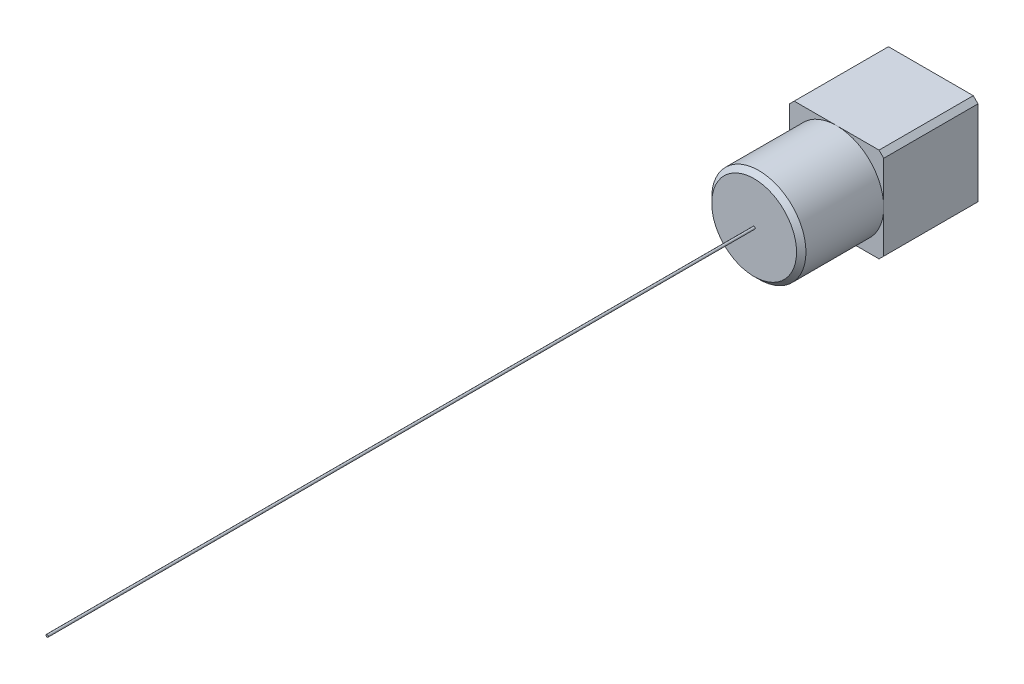
ISO-10303-21;
HEADER;
FILE_DESCRIPTION(('STEP AP214'),'2;1');
FILE_NAME('part.step','',(''),(''),'','','');
FILE_SCHEMA(('AUTOMOTIVE_DESIGN { 1 0 10303 214 1 1 1 1 }'));
ENDSEC;
DATA;
#1=APPLICATION_CONTEXT('core data for automotive mechanical design processes');
#2=APPLICATION_PROTOCOL_DEFINITION('international standard','automotive_design',2000,#1);
#3=PRODUCT_CONTEXT('',#1,'mechanical');
#4=PRODUCT('Part','Part','',(#3));
#5=PRODUCT_RELATED_PRODUCT_CATEGORY('part','',(#4));
#6=PRODUCT_DEFINITION_FORMATION('','',#4);
#7=PRODUCT_DEFINITION_CONTEXT('part definition',#1,'design');
#8=PRODUCT_DEFINITION('design','',#6,#7);
#9=PRODUCT_DEFINITION_SHAPE('','',#8);
#10=(LENGTH_UNIT() NAMED_UNIT(*) SI_UNIT(.MILLI.,.METRE.));
#11=(NAMED_UNIT(*) PLANE_ANGLE_UNIT() SI_UNIT($,.RADIAN.));
#12=(NAMED_UNIT(*) SI_UNIT($,.STERADIAN.) SOLID_ANGLE_UNIT());
#13=UNCERTAINTY_MEASURE_WITH_UNIT(LENGTH_MEASURE(1.E-05),#10,'distance_accuracy_value','');
#14=(GEOMETRIC_REPRESENTATION_CONTEXT(3) GLOBAL_UNCERTAINTY_ASSIGNED_CONTEXT((#13)) GLOBAL_UNIT_ASSIGNED_CONTEXT((#10,
#11,#12)) REPRESENTATION_CONTEXT('',''));
#15=CARTESIAN_POINT('',(0.,0.,0.));
#16=DIRECTION('',(0.,0.,1.));
#17=DIRECTION('',(1.,0.,0.));
#18=AXIS2_PLACEMENT_3D('',#15,#16,#17);
#19=CARTESIAN_POINT('',(0.,0.,75.));
#20=DIRECTION('',(0.,0.,1.));
#21=DIRECTION('',(1.,0.,0.));
#22=AXIS2_PLACEMENT_3D('',#19,#20,#21);
#23=PLANE('',#22);
#24=CARTESIAN_POINT('',(0.,0.,75.));
#25=DIRECTION('',(0.,0.,1.));
#26=DIRECTION('',(1.,0.,0.));
#27=AXIS2_PLACEMENT_3D('',#24,#25,#26);
#28=CIRCLE('',#27,18.);
#29=CARTESIAN_POINT('',(18.,0.,75.));
#30=VERTEX_POINT('',#29);
#31=EDGE_CURVE('E42',#30,#30,#28,.T.);
#32=ORIENTED_EDGE('',*,*,#31,.T.);
#33=EDGE_LOOP('',(#32));
#34=FACE_BOUND('',#33,.T.);
#35=CARTESIAN_POINT('',(0.,0.,75.));
#36=DIRECTION('',(0.,0.,1.));
#37=DIRECTION('',(1.,0.,0.));
#38=AXIS2_PLACEMENT_3D('',#35,#36,#37);
#39=CIRCLE('',#38,0.5);
#40=CARTESIAN_POINT('',(0.5,0.,75.));
#41=VERTEX_POINT('',#40);
#42=EDGE_CURVE('E153',#41,#41,#39,.T.);
#43=ORIENTED_EDGE('',*,*,#42,.F.);
#44=EDGE_LOOP('',(#43));
#45=FACE_BOUND('',#44,.T.);
#46=ADVANCED_FACE('F34',(#34,#45),#23,.T.);
#47=CARTESIAN_POINT('',(0.,0.,0.));
#48=DIRECTION('',(0.,0.,1.));
#49=DIRECTION('',(1.,0.,0.));
#50=AXIS2_PLACEMENT_3D('',#47,#48,#49);
#51=PLANE('',#50);
#52=CARTESIAN_POINT('',(-8.63222484007207,8.08184808852399,0.));
#53=DIRECTION('',(0.,0.,1.));
#54=DIRECTION('',(1.,0.,0.));
#55=AXIS2_PLACEMENT_3D('',#52,#53,#54);
#56=CIRCLE('',#55,3.93917618800255);
#57=CARTESIAN_POINT('',(-4.69304865206951,8.08184808852399,0.));
#58=VERTEX_POINT('',#57);
#59=EDGE_CURVE('E172',#58,#58,#56,.T.);
#60=ORIENTED_EDGE('',*,*,#59,.T.);
#61=EDGE_LOOP('',(#60));
#62=FACE_BOUND('',#61,.T.);
#63=DIRECTION('',(0.,1.,0.));
#64=VECTOR('',#63,1.);
#65=CARTESIAN_POINT('',(20.,-20.,0.));
#66=LINE('',#65,#64);
#67=CARTESIAN_POINT('',(20.,-18.,0.));
#68=VERTEX_POINT('',#67);
#69=CARTESIAN_POINT('',(20.,18.,0.));
#70=VERTEX_POINT('',#69);
#71=EDGE_CURVE('E165',#68,#70,#66,.T.);
#72=ORIENTED_EDGE('',*,*,#71,.F.);
#73=DIRECTION('',(0.70710678118655,0.707106781186545,0.));
#74=VECTOR('',#73,1.);
#75=CARTESIAN_POINT('',(20.,-18.,0.));
#76=LINE('',#75,#74);
#77=CARTESIAN_POINT('',(18.,-20.,0.));
#78=VERTEX_POINT('',#77);
#79=EDGE_CURVE('E190',#68,#78,#76,.F.);
#80=ORIENTED_EDGE('',*,*,#79,.T.);
#81=DIRECTION('',(1.,0.,0.));
#82=VECTOR('',#81,1.);
#83=CARTESIAN_POINT('',(20.,-20.,0.));
#84=LINE('',#83,#82);
#85=CARTESIAN_POINT('',(-18.,-20.,0.));
#86=VERTEX_POINT('',#85);
#87=EDGE_CURVE('E162',#86,#78,#84,.T.);
#88=ORIENTED_EDGE('',*,*,#87,.F.);
#89=DIRECTION('',(0.707106781186545,-0.70710678118655,0.));
#90=VECTOR('',#89,1.);
#91=CARTESIAN_POINT('',(-18.,-20.,0.));
#92=LINE('',#91,#90);
#93=CARTESIAN_POINT('',(-20.,-18.,0.));
#94=VERTEX_POINT('',#93);
#95=EDGE_CURVE('E188',#86,#94,#92,.F.);
#96=ORIENTED_EDGE('',*,*,#95,.T.);
#97=DIRECTION('',(0.,-1.,0.));
#98=VECTOR('',#97,1.);
#99=CARTESIAN_POINT('',(-20.,-20.,0.));
#100=LINE('',#99,#98);
#101=CARTESIAN_POINT('',(-20.,18.,0.));
#102=VERTEX_POINT('',#101);
#103=EDGE_CURVE('E142',#102,#94,#100,.T.);
#104=ORIENTED_EDGE('',*,*,#103,.F.);
#105=DIRECTION('',(-0.707106781186551,-0.707106781186544,0.));
#106=VECTOR('',#105,1.);
#107=CARTESIAN_POINT('',(-20.,18.,0.));
#108=LINE('',#107,#106);
#109=CARTESIAN_POINT('',(-18.,20.,0.));
#110=VERTEX_POINT('',#109);
#111=EDGE_CURVE('E184',#102,#110,#108,.F.);
#112=ORIENTED_EDGE('',*,*,#111,.T.);
#113=DIRECTION('',(-1.,0.,0.));
#114=VECTOR('',#113,1.);
#115=CARTESIAN_POINT('',(20.,20.,0.));
#116=LINE('',#115,#114);
#117=CARTESIAN_POINT('',(18.,20.,0.));
#118=VERTEX_POINT('',#117);
#119=EDGE_CURVE('E167',#118,#110,#116,.T.);
#120=ORIENTED_EDGE('',*,*,#119,.F.);
#121=DIRECTION('',(-0.70710678118655,0.707106781186545,0.));
#122=VECTOR('',#121,1.);
#123=CARTESIAN_POINT('',(18.,20.,0.));
#124=LINE('',#123,#122);
#125=EDGE_CURVE('E186',#118,#70,#124,.F.);
#126=ORIENTED_EDGE('',*,*,#125,.T.);
#127=EDGE_LOOP('',(#72,#80,#88,#96,#104,#112,#120,#126));
#128=FACE_BOUND('',#127,.T.);
#129=ADVANCED_FACE('F231',(#62,#128),#51,.F.);
#130=CARTESIAN_POINT('',(0.,0.,40.));
#131=DIRECTION('',(0.,0.,1.));
#132=DIRECTION('',(1.,0.,0.));
#133=AXIS2_PLACEMENT_3D('',#130,#131,#132);
#134=PLANE('',#133);
#135=DIRECTION('',(0.,1.,0.));
#136=VECTOR('',#135,1.);
#137=CARTESIAN_POINT('',(20.,-20.,40.));
#138=LINE('',#137,#136);
#139=CARTESIAN_POINT('',(20.,0.,40.));
#140=VERTEX_POINT('',#139);
#141=CARTESIAN_POINT('',(20.,18.,40.));
#142=VERTEX_POINT('',#141);
#143=EDGE_CURVE('E127',#140,#142,#138,.T.);
#144=ORIENTED_EDGE('',*,*,#143,.T.);
#145=DIRECTION('',(0.70710678118655,-0.707106781186545,0.));
#146=VECTOR('',#145,1.);
#147=CARTESIAN_POINT('',(18.9999999999999,19.0000000000001,40.));
#148=LINE('',#147,#146);
#149=CARTESIAN_POINT('',(18.,20.,40.));
#150=VERTEX_POINT('',#149);
#151=EDGE_CURVE('E49',#142,#150,#148,.F.);
#152=ORIENTED_EDGE('',*,*,#151,.T.);
#153=DIRECTION('',(-1.,0.,0.));
#154=VECTOR('',#153,1.);
#155=CARTESIAN_POINT('',(20.,20.,40.));
#156=LINE('',#155,#154);
#157=CARTESIAN_POINT('',(0.,20.,40.));
#158=VERTEX_POINT('',#157);
#159=EDGE_CURVE('E138',#150,#158,#156,.T.);
#160=ORIENTED_EDGE('',*,*,#159,.T.);
#161=CARTESIAN_POINT('',(0.,0.,40.));
#162=DIRECTION('',(0.,0.,1.));
#163=DIRECTION('',(1.,0.,0.));
#164=AXIS2_PLACEMENT_3D('',#161,#162,#163);
#165=CIRCLE('',#164,20.);
#166=EDGE_CURVE('E136',#140,#158,#165,.T.);
#167=ORIENTED_EDGE('',*,*,#166,.F.);
#168=EDGE_LOOP('',(#144,#152,#160,#167));
#169=FACE_BOUND('',#168,.T.);
#170=ADVANCED_FACE('F137',(#169),#134,.T.);
#171=CARTESIAN_POINT('',(-18.,20.,40.));
#172=VERTEX_POINT('',#171);
#173=EDGE_CURVE('E126',#158,#172,#156,.T.);
#174=ORIENTED_EDGE('',*,*,#173,.T.);
#175=DIRECTION('',(0.707106781186551,0.707106781186544,0.));
#176=VECTOR('',#175,1.);
#177=CARTESIAN_POINT('',(-18.9999999999999,19.0000000000001,40.));
#178=LINE('',#177,#176);
#179=CARTESIAN_POINT('',(-20.,18.,40.));
#180=VERTEX_POINT('',#179);
#181=EDGE_CURVE('E210',#172,#180,#178,.F.);
#182=ORIENTED_EDGE('',*,*,#181,.T.);
#183=DIRECTION('',(0.,-1.,0.));
#184=VECTOR('',#183,1.);
#185=CARTESIAN_POINT('',(-20.,-20.,40.));
#186=LINE('',#185,#184);
#187=CARTESIAN_POINT('',(-20.,0.,40.));
#188=VERTEX_POINT('',#187);
#189=EDGE_CURVE('E155',#180,#188,#186,.T.);
#190=ORIENTED_EDGE('',*,*,#189,.T.);
#191=EDGE_CURVE('E145',#158,#188,#165,.T.);
#192=ORIENTED_EDGE('',*,*,#191,.F.);
#193=EDGE_LOOP('',(#174,#182,#190,#192));
#194=FACE_BOUND('',#193,.T.);
#195=ADVANCED_FACE('F294',(#194),#134,.T.);
#196=CARTESIAN_POINT('',(-20.,-18.,40.));
#197=VERTEX_POINT('',#196);
#198=EDGE_CURVE('E158',#188,#197,#186,.T.);
#199=ORIENTED_EDGE('',*,*,#198,.T.);
#200=DIRECTION('',(-0.707106781186545,0.70710678118655,0.));
#201=VECTOR('',#200,1.);
#202=CARTESIAN_POINT('',(-19.0000000000001,-18.9999999999999,40.));
#203=LINE('',#202,#201);
#204=CARTESIAN_POINT('',(-18.,-20.,40.));
#205=VERTEX_POINT('',#204);
#206=EDGE_CURVE('E203',#197,#205,#203,.F.);
#207=ORIENTED_EDGE('',*,*,#206,.T.);
#208=DIRECTION('',(1.,0.,0.));
#209=VECTOR('',#208,1.);
#210=CARTESIAN_POINT('',(20.,-20.,40.));
#211=LINE('',#210,#209);
#212=CARTESIAN_POINT('',(0.,-20.,40.));
#213=VERTEX_POINT('',#212);
#214=EDGE_CURVE('E134',#205,#213,#211,.T.);
#215=ORIENTED_EDGE('',*,*,#214,.T.);
#216=EDGE_CURVE('E149',#188,#213,#165,.T.);
#217=ORIENTED_EDGE('',*,*,#216,.F.);
#218=EDGE_LOOP('',(#199,#207,#215,#217));
#219=FACE_BOUND('',#218,.T.);
#220=ADVANCED_FACE('F247',(#219),#134,.T.);
#221=CARTESIAN_POINT('',(-20.,-20.,40.));
#222=DIRECTION('',(1.,0.,0.));
#223=DIRECTION('',(0.,0.,-1.));
#224=AXIS2_PLACEMENT_3D('',#221,#222,#223);
#225=PLANE('',#224);
#226=ORIENTED_EDGE('',*,*,#103,.T.);
#227=DIRECTION('',(0.,0.,1.));
#228=VECTOR('',#227,1.);
#229=CARTESIAN_POINT('',(-20.,-18.,40.));
#230=LINE('',#229,#228);
#231=EDGE_CURVE('E201',#94,#197,#230,.T.);
#232=ORIENTED_EDGE('',*,*,#231,.T.);
#233=ORIENTED_EDGE('',*,*,#198,.F.);
#234=ORIENTED_EDGE('',*,*,#189,.F.);
#235=DIRECTION('',(0.,0.,-1.));
#236=VECTOR('',#235,1.);
#237=CARTESIAN_POINT('',(-20.,18.,40.));
#238=LINE('',#237,#236);
#239=EDGE_CURVE('E198',#180,#102,#238,.T.);
#240=ORIENTED_EDGE('',*,*,#239,.T.);
#241=EDGE_LOOP('',(#226,#232,#233,#234,#240));
#242=FACE_BOUND('',#241,.T.);
#243=ADVANCED_FACE('F256',(#242),#225,.F.);
#244=CARTESIAN_POINT('',(20.,-20.,40.));
#245=DIRECTION('',(0.,1.,0.));
#246=DIRECTION('',(-1.,0.,0.));
#247=AXIS2_PLACEMENT_3D('',#244,#245,#246);
#248=PLANE('',#247);
#249=ORIENTED_EDGE('',*,*,#87,.T.);
#250=DIRECTION('',(0.,0.,1.));
#251=VECTOR('',#250,1.);
#252=CARTESIAN_POINT('',(18.,-20.,40.));
#253=LINE('',#252,#251);
#254=CARTESIAN_POINT('',(18.,-20.,40.));
#255=VERTEX_POINT('',#254);
#256=EDGE_CURVE('E195',#78,#255,#253,.T.);
#257=ORIENTED_EDGE('',*,*,#256,.T.);
#258=EDGE_CURVE('E157',#213,#255,#211,.T.);
#259=ORIENTED_EDGE('',*,*,#258,.F.);
#260=ORIENTED_EDGE('',*,*,#214,.F.);
#261=DIRECTION('',(0.,0.,-1.));
#262=VECTOR('',#261,1.);
#263=CARTESIAN_POINT('',(-18.,-20.,40.));
#264=LINE('',#263,#262);
#265=EDGE_CURVE('E192',#205,#86,#264,.T.);
#266=ORIENTED_EDGE('',*,*,#265,.T.);
#267=EDGE_LOOP('',(#249,#257,#259,#260,#266));
#268=FACE_BOUND('',#267,.T.);
#269=ADVANCED_FACE('F253',(#268),#248,.F.);
#270=CARTESIAN_POINT('',(20.,-20.,40.));
#271=DIRECTION('',(-1.,0.,0.));
#272=DIRECTION('',(0.,0.,1.));
#273=AXIS2_PLACEMENT_3D('',#270,#271,#272);
#274=PLANE('',#273);
#275=CARTESIAN_POINT('',(20.,-18.,40.));
#276=VERTEX_POINT('',#275);
#277=EDGE_CURVE('E114',#276,#140,#138,.T.);
#278=ORIENTED_EDGE('',*,*,#277,.F.);
#279=DIRECTION('',(0.,0.,-1.));
#280=VECTOR('',#279,1.);
#281=CARTESIAN_POINT('',(20.,-18.,40.));
#282=LINE('',#281,#280);
#283=EDGE_CURVE('E182',#276,#68,#282,.T.);
#284=ORIENTED_EDGE('',*,*,#283,.T.);
#285=ORIENTED_EDGE('',*,*,#71,.T.);
#286=DIRECTION('',(0.,0.,1.));
#287=VECTOR('',#286,1.);
#288=CARTESIAN_POINT('',(20.,18.,40.));
#289=LINE('',#288,#287);
#290=EDGE_CURVE('E133',#70,#142,#289,.T.);
#291=ORIENTED_EDGE('',*,*,#290,.T.);
#292=ORIENTED_EDGE('',*,*,#143,.F.);
#293=EDGE_LOOP('',(#278,#284,#285,#291,#292));
#294=FACE_BOUND('',#293,.T.);
#295=ADVANCED_FACE('F130',(#294),#274,.F.);
#296=CARTESIAN_POINT('',(20.,20.,40.));
#297=DIRECTION('',(0.,-1.,0.));
#298=DIRECTION('',(1.,0.,0.));
#299=AXIS2_PLACEMENT_3D('',#296,#297,#298);
#300=PLANE('',#299);
#301=ORIENTED_EDGE('',*,*,#159,.F.);
#302=DIRECTION('',(0.,0.,-1.));
#303=VECTOR('',#302,1.);
#304=CARTESIAN_POINT('',(18.,20.,40.));
#305=LINE('',#304,#303);
#306=EDGE_CURVE('E206',#150,#118,#305,.T.);
#307=ORIENTED_EDGE('',*,*,#306,.T.);
#308=ORIENTED_EDGE('',*,*,#119,.T.);
#309=DIRECTION('',(0.,0.,1.));
#310=VECTOR('',#309,1.);
#311=CARTESIAN_POINT('',(-18.,20.,40.));
#312=LINE('',#311,#310);
#313=EDGE_CURVE('E57',#110,#172,#312,.T.);
#314=ORIENTED_EDGE('',*,*,#313,.T.);
#315=ORIENTED_EDGE('',*,*,#173,.F.);
#316=EDGE_LOOP('',(#301,#307,#308,#314,#315));
#317=FACE_BOUND('',#316,.T.);
#318=ADVANCED_FACE('F246',(#317),#300,.F.);
#319=ORIENTED_EDGE('',*,*,#258,.T.);
#320=DIRECTION('',(-0.70710678118655,-0.707106781186545,0.));
#321=VECTOR('',#320,1.);
#322=CARTESIAN_POINT('',(18.9999999999999,-19.0000000000001,40.));
#323=LINE('',#322,#321);
#324=EDGE_CURVE('E122',#255,#276,#323,.F.);
#325=ORIENTED_EDGE('',*,*,#324,.T.);
#326=ORIENTED_EDGE('',*,*,#277,.T.);
#327=EDGE_CURVE('E119',#213,#140,#165,.T.);
#328=ORIENTED_EDGE('',*,*,#327,.F.);
#329=EDGE_LOOP('',(#319,#325,#326,#328));
#330=FACE_BOUND('',#329,.T.);
#331=ADVANCED_FACE('F117',(#330),#134,.T.);
#332=CARTESIAN_POINT('',(0.,0.,75.));
#333=DIRECTION('',(0.,0.,-1.));
#334=DIRECTION('',(-1.,0.,0.));
#335=AXIS2_PLACEMENT_3D('',#332,#333,#334);
#336=CYLINDRICAL_SURFACE('',#335,20.);
#337=CARTESIAN_POINT('',(0.,0.,73.));
#338=DIRECTION('',(0.,0.,1.));
#339=DIRECTION('',(1.,0.,0.));
#340=AXIS2_PLACEMENT_3D('',#337,#338,#339);
#341=CIRCLE('',#340,20.);
#342=CARTESIAN_POINT('',(20.,0.,73.));
#343=VERTEX_POINT('',#342);
#344=EDGE_CURVE('E11',#343,#343,#341,.F.);
#345=ORIENTED_EDGE('',*,*,#344,.T.);
#346=EDGE_LOOP('',(#345));
#347=FACE_BOUND('',#346,.T.);
#348=ORIENTED_EDGE('',*,*,#166,.T.);
#349=ORIENTED_EDGE('',*,*,#191,.T.);
#350=ORIENTED_EDGE('',*,*,#216,.T.);
#351=ORIENTED_EDGE('',*,*,#327,.T.);
#352=EDGE_LOOP('',(#348,#349,#350,#351));
#353=FACE_BOUND('',#352,.T.);
#354=ADVANCED_FACE('F147',(#347,#353),#336,.T.);
#355=CARTESIAN_POINT('',(-8.63222484007207,8.08184808852399,-5.));
#356=DIRECTION('',(0.,0.,1.));
#357=DIRECTION('',(1.,0.,0.));
#358=AXIS2_PLACEMENT_3D('',#355,#356,#357);
#359=CYLINDRICAL_SURFACE('',#358,3.43917618800255);
#360=CARTESIAN_POINT('',(-8.63222484007207,8.08184808852399,-4.50000000000001));
#361=DIRECTION('',(0.,0.,-1.));
#362=DIRECTION('',(-1.,0.,0.));
#363=AXIS2_PLACEMENT_3D('',#360,#361,#362);
#364=CIRCLE('',#363,3.43917618800255);
#365=CARTESIAN_POINT('',(-12.0714010280746,8.08184808852399,-4.50000000000001));
#366=VERTEX_POINT('',#365);
#367=EDGE_CURVE('E178',#366,#366,#364,.F.);
#368=ORIENTED_EDGE('',*,*,#367,.T.);
#369=EDGE_LOOP('',(#368));
#370=FACE_BOUND('',#369,.T.);
#371=CARTESIAN_POINT('',(-8.63222484007207,8.08184808852399,-0.5));
#372=DIRECTION('',(0.,0.,1.));
#373=DIRECTION('',(1.,0.,0.));
#374=AXIS2_PLACEMENT_3D('',#371,#372,#373);
#375=CIRCLE('',#374,3.43917618800255);
#376=CARTESIAN_POINT('',(-5.19304865206951,8.08184808852399,-0.5));
#377=VERTEX_POINT('',#376);
#378=EDGE_CURVE('E169',#377,#377,#375,.F.);
#379=ORIENTED_EDGE('',*,*,#378,.T.);
#380=EDGE_LOOP('',(#379));
#381=FACE_BOUND('',#380,.T.);
#382=ADVANCED_FACE('F240',(#370,#381),#359,.T.);
#383=CARTESIAN_POINT('',(-8.63222484007207,8.08184808852399,-5.));
#384=DIRECTION('',(0.,0.,-1.));
#385=DIRECTION('',(-1.,0.,0.));
#386=AXIS2_PLACEMENT_3D('',#383,#384,#385);
#387=PLANE('',#386);
#388=CARTESIAN_POINT('',(-8.63222484007207,8.08184808852399,-5.));
#389=DIRECTION('',(0.,0.,-1.));
#390=DIRECTION('',(-1.,0.,0.));
#391=AXIS2_PLACEMENT_3D('',#388,#389,#390);
#392=CIRCLE('',#391,2.93917618800257);
#393=CARTESIAN_POINT('',(-11.5714010280746,8.08184808852399,-5.));
#394=VERTEX_POINT('',#393);
#395=EDGE_CURVE('E175',#394,#394,#392,.T.);
#396=ORIENTED_EDGE('',*,*,#395,.T.);
#397=EDGE_LOOP('',(#396));
#398=FACE_BOUND('',#397,.T.);
#399=ADVANCED_FACE('F265',(#398),#387,.T.);
#400=CARTESIAN_POINT('',(-8.63222484007207,8.08184808852399,-0.5));
#401=DIRECTION('',(0.,0.,1.));
#402=DIRECTION('',(1.,0.,0.));
#403=AXIS2_PLACEMENT_3D('',#400,#401,#402);
#404=TOROIDAL_SURFACE('',#403,3.93917618800255,0.5);
#405=ORIENTED_EDGE('',*,*,#59,.F.);
#406=EDGE_LOOP('',(#405));
#407=FACE_BOUND('',#406,.T.);
#408=ORIENTED_EDGE('',*,*,#378,.F.);
#409=EDGE_LOOP('',(#408));
#410=FACE_BOUND('',#409,.T.);
#411=ADVANCED_FACE('F261',(#407,#410),#404,.F.);
#412=CARTESIAN_POINT('',(-8.63222484007207,8.08184808852399,-5.));
#413=DIRECTION('',(0.,0.,1.));
#414=DIRECTION('',(1.,0.,0.));
#415=AXIS2_PLACEMENT_3D('',#412,#413,#414);
#416=CONICAL_SURFACE('',#415,2.93917618800257,0.785398163397437);
#417=ORIENTED_EDGE('',*,*,#367,.F.);
#418=EDGE_LOOP('',(#417));
#419=FACE_BOUND('',#418,.T.);
#420=ORIENTED_EDGE('',*,*,#395,.F.);
#421=EDGE_LOOP('',(#420));
#422=FACE_BOUND('',#421,.T.);
#423=ADVANCED_FACE('F264',(#419,#422),#416,.T.);
#424=CARTESIAN_POINT('',(20.,-18.,40.));
#425=DIRECTION('',(-0.707106781186545,0.70710678118655,0.));
#426=DIRECTION('',(0.,0.,-1.));
#427=AXIS2_PLACEMENT_3D('',#424,#425,#426);
#428=PLANE('',#427);
#429=ORIENTED_EDGE('',*,*,#324,.F.);
#430=ORIENTED_EDGE('',*,*,#256,.F.);
#431=ORIENTED_EDGE('',*,*,#79,.F.);
#432=ORIENTED_EDGE('',*,*,#283,.F.);
#433=EDGE_LOOP('',(#429,#430,#431,#432));
#434=FACE_BOUND('',#433,.T.);
#435=ADVANCED_FACE('F269',(#434),#428,.F.);
#436=CARTESIAN_POINT('',(-18.,-20.,40.));
#437=DIRECTION('',(0.70710678118655,0.707106781186545,0.));
#438=DIRECTION('',(0.,0.,-1.));
#439=AXIS2_PLACEMENT_3D('',#436,#437,#438);
#440=PLANE('',#439);
#441=ORIENTED_EDGE('',*,*,#206,.F.);
#442=ORIENTED_EDGE('',*,*,#231,.F.);
#443=ORIENTED_EDGE('',*,*,#95,.F.);
#444=ORIENTED_EDGE('',*,*,#265,.F.);
#445=EDGE_LOOP('',(#441,#442,#443,#444));
#446=FACE_BOUND('',#445,.T.);
#447=ADVANCED_FACE('F273',(#446),#440,.F.);
#448=CARTESIAN_POINT('',(18.,20.,40.));
#449=DIRECTION('',(-0.707106781186545,-0.70710678118655,0.));
#450=DIRECTION('',(0.,0.,-1.));
#451=AXIS2_PLACEMENT_3D('',#448,#449,#450);
#452=PLANE('',#451);
#453=ORIENTED_EDGE('',*,*,#151,.F.);
#454=ORIENTED_EDGE('',*,*,#290,.F.);
#455=ORIENTED_EDGE('',*,*,#125,.F.);
#456=ORIENTED_EDGE('',*,*,#306,.F.);
#457=EDGE_LOOP('',(#453,#454,#455,#456));
#458=FACE_BOUND('',#457,.T.);
#459=ADVANCED_FACE('F227',(#458),#452,.F.);
#460=CARTESIAN_POINT('',(-20.,18.,40.));
#461=DIRECTION('',(0.707106781186544,-0.707106781186551,0.));
#462=DIRECTION('',(0.,0.,-1.));
#463=AXIS2_PLACEMENT_3D('',#460,#461,#462);
#464=PLANE('',#463);
#465=ORIENTED_EDGE('',*,*,#181,.F.);
#466=ORIENTED_EDGE('',*,*,#313,.F.);
#467=ORIENTED_EDGE('',*,*,#111,.F.);
#468=ORIENTED_EDGE('',*,*,#239,.F.);
#469=EDGE_LOOP('',(#465,#466,#467,#468));
#470=FACE_BOUND('',#469,.T.);
#471=ADVANCED_FACE('F218',(#470),#464,.F.);
#472=CARTESIAN_POINT('',(0.,0.,75.));
#473=DIRECTION('',(0.,0.,-1.));
#474=DIRECTION('',(-1.,0.,0.));
#475=AXIS2_PLACEMENT_3D('',#472,#473,#474);
#476=CONICAL_SURFACE('',#475,18.,0.785398163397447);
#477=ORIENTED_EDGE('',*,*,#344,.F.);
#478=EDGE_LOOP('',(#477));
#479=FACE_BOUND('',#478,.T.);
#480=ORIENTED_EDGE('',*,*,#31,.F.);
#481=EDGE_LOOP('',(#480));
#482=FACE_BOUND('',#481,.T.);
#483=ADVANCED_FACE('F36',(#479,#482),#476,.T.);
#484=CARTESIAN_POINT('',(0.,0.,375.));
#485=DIRECTION('',(0.,0.,-1.));
#486=DIRECTION('',(-1.,0.,0.));
#487=AXIS2_PLACEMENT_3D('',#484,#485,#486);
#488=CYLINDRICAL_SURFACE('',#487,0.5);
#489=CARTESIAN_POINT('',(0.,0.,375.));
#490=DIRECTION('',(0.,0.,1.));
#491=DIRECTION('',(1.,0.,0.));
#492=AXIS2_PLACEMENT_3D('',#489,#490,#491);
#493=CIRCLE('',#492,0.5);
#494=CARTESIAN_POINT('',(0.5,0.,375.));
#495=VERTEX_POINT('',#494);
#496=EDGE_CURVE('E143',#495,#495,#493,.T.);
#497=ORIENTED_EDGE('',*,*,#496,.F.);
#498=EDGE_LOOP('',(#497));
#499=FACE_BOUND('',#498,.T.);
#500=ORIENTED_EDGE('',*,*,#42,.T.);
#501=EDGE_LOOP('',(#500));
#502=FACE_BOUND('',#501,.T.);
#503=ADVANCED_FACE('F217',(#499,#502),#488,.T.);
#504=CARTESIAN_POINT('',(0.,0.,375.));
#505=DIRECTION('',(0.,0.,1.));
#506=DIRECTION('',(1.,0.,0.));
#507=AXIS2_PLACEMENT_3D('',#504,#505,#506);
#508=PLANE('',#507);
#509=ORIENTED_EDGE('',*,*,#496,.T.);
#510=EDGE_LOOP('',(#509));
#511=FACE_BOUND('',#510,.T.);
#512=ADVANCED_FACE('F224',(#511),#508,.T.);
#513=CLOSED_SHELL('',(#46,#129,#170,#195,#220,#243,#269,#295,#318,#331,#354,#382,#399,#411,#423,
#435,#447,#459,#471,#483,#503,#512));
#514=MANIFOLD_SOLID_BREP('B2',#513);
#515=ADVANCED_BREP_SHAPE_REPRESENTATION('',(#18,#514),#14);
#516=SHAPE_DEFINITION_REPRESENTATION(#9,#515);
ENDSEC;
END-ISO-10303-21;
